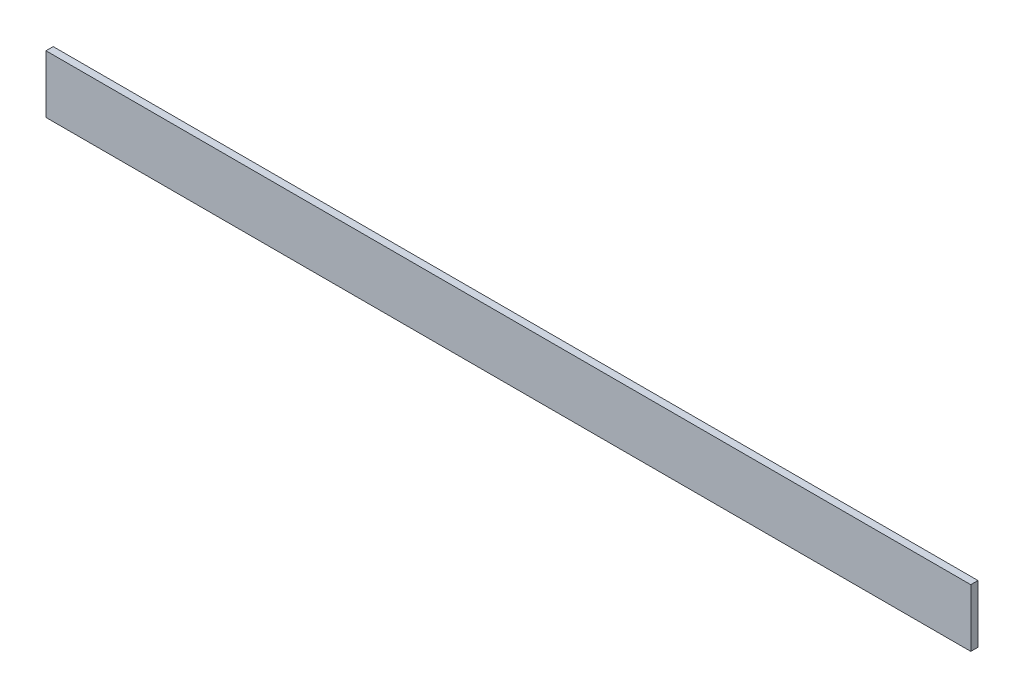
ISO-10303-21;
HEADER;
FILE_DESCRIPTION(('STEP AP214'),'2;1');
FILE_NAME('part.step','',(''),(''),'','','');
FILE_SCHEMA(('AUTOMOTIVE_DESIGN { 1 0 10303 214 1 1 1 1 }'));
ENDSEC;
DATA;
#1=APPLICATION_CONTEXT('core data for automotive mechanical design processes');
#2=APPLICATION_PROTOCOL_DEFINITION('international standard','automotive_design',2000,#1);
#3=PRODUCT_CONTEXT('',#1,'mechanical');
#4=PRODUCT('Part','Part','',(#3));
#5=PRODUCT_RELATED_PRODUCT_CATEGORY('part','',(#4));
#6=PRODUCT_DEFINITION_FORMATION('','',#4);
#7=PRODUCT_DEFINITION_CONTEXT('part definition',#1,'design');
#8=PRODUCT_DEFINITION('design','',#6,#7);
#9=PRODUCT_DEFINITION_SHAPE('','',#8);
#10=(LENGTH_UNIT() NAMED_UNIT(*) SI_UNIT(.MILLI.,.METRE.));
#11=(NAMED_UNIT(*) PLANE_ANGLE_UNIT() SI_UNIT($,.RADIAN.));
#12=(NAMED_UNIT(*) SI_UNIT($,.STERADIAN.) SOLID_ANGLE_UNIT());
#13=UNCERTAINTY_MEASURE_WITH_UNIT(LENGTH_MEASURE(1.E-05),#10,'distance_accuracy_value','');
#14=(GEOMETRIC_REPRESENTATION_CONTEXT(3) GLOBAL_UNCERTAINTY_ASSIGNED_CONTEXT((#13)) GLOBAL_UNIT_ASSIGNED_CONTEXT((#10,
#11,#12)) REPRESENTATION_CONTEXT('',''));
#15=CARTESIAN_POINT('',(0.,0.,0.));
#16=DIRECTION('',(0.,0.,1.));
#17=DIRECTION('',(1.,0.,0.));
#18=AXIS2_PLACEMENT_3D('',#15,#16,#17);
#19=CARTESIAN_POINT('',(320.,-20.,5.));
#20=DIRECTION('',(-1.,0.,0.));
#21=DIRECTION('',(0.,0.,1.));
#22=AXIS2_PLACEMENT_3D('',#19,#20,#21);
#23=PLANE('',#22);
#24=DIRECTION('',(0.,1.,0.));
#25=VECTOR('',#24,1.);
#26=CARTESIAN_POINT('',(320.,-20.,0.));
#27=LINE('',#26,#25);
#28=CARTESIAN_POINT('',(320.,-20.,0.));
#29=VERTEX_POINT('',#28);
#30=CARTESIAN_POINT('',(320.,20.,0.));
#31=VERTEX_POINT('',#30);
#32=EDGE_CURVE('E96',#29,#31,#27,.T.);
#33=ORIENTED_EDGE('',*,*,#32,.T.);
#34=DIRECTION('',(0.,0.,-1.));
#35=VECTOR('',#34,1.);
#36=CARTESIAN_POINT('',(320.,20.,5.));
#37=LINE('',#36,#35);
#38=CARTESIAN_POINT('',(320.,20.,5.));
#39=VERTEX_POINT('',#38);
#40=EDGE_CURVE('E11',#39,#31,#37,.T.);
#41=ORIENTED_EDGE('',*,*,#40,.F.);
#42=DIRECTION('',(0.,1.,0.));
#43=VECTOR('',#42,1.);
#44=CARTESIAN_POINT('',(320.,-20.,5.));
#45=LINE('',#44,#43);
#46=CARTESIAN_POINT('',(320.,-20.,5.));
#47=VERTEX_POINT('',#46);
#48=EDGE_CURVE('E84',#47,#39,#45,.T.);
#49=ORIENTED_EDGE('',*,*,#48,.F.);
#50=DIRECTION('',(0.,0.,-1.));
#51=VECTOR('',#50,1.);
#52=CARTESIAN_POINT('',(320.,-20.,5.));
#53=LINE('',#52,#51);
#54=EDGE_CURVE('E92',#47,#29,#53,.T.);
#55=ORIENTED_EDGE('',*,*,#54,.T.);
#56=EDGE_LOOP('',(#33,#41,#49,#55));
#57=FACE_BOUND('',#56,.T.);
#58=ADVANCED_FACE('F33',(#57),#23,.F.);
#59=CARTESIAN_POINT('',(-320.,20.,5.));
#60=DIRECTION('',(0.,-1.,0.));
#61=DIRECTION('',(0.,0.,-1.));
#62=AXIS2_PLACEMENT_3D('',#59,#60,#61);
#63=PLANE('',#62);
#64=DIRECTION('',(-1.,0.,0.));
#65=VECTOR('',#64,1.);
#66=CARTESIAN_POINT('',(-320.,20.,0.));
#67=LINE('',#66,#65);
#68=CARTESIAN_POINT('',(-320.,20.,0.));
#69=VERTEX_POINT('',#68);
#70=EDGE_CURVE('E88',#31,#69,#67,.T.);
#71=ORIENTED_EDGE('',*,*,#70,.T.);
#72=DIRECTION('',(0.,0.,-1.));
#73=VECTOR('',#72,1.);
#74=CARTESIAN_POINT('',(-320.,20.,5.));
#75=LINE('',#74,#73);
#76=CARTESIAN_POINT('',(-320.,20.,5.));
#77=VERTEX_POINT('',#76);
#78=EDGE_CURVE('E41',#77,#69,#75,.T.);
#79=ORIENTED_EDGE('',*,*,#78,.F.);
#80=DIRECTION('',(-1.,0.,0.));
#81=VECTOR('',#80,1.);
#82=CARTESIAN_POINT('',(-320.,20.,5.));
#83=LINE('',#82,#81);
#84=EDGE_CURVE('E79',#39,#77,#83,.T.);
#85=ORIENTED_EDGE('',*,*,#84,.F.);
#86=ORIENTED_EDGE('',*,*,#40,.T.);
#87=EDGE_LOOP('',(#71,#79,#85,#86));
#88=FACE_BOUND('',#87,.T.);
#89=ADVANCED_FACE('F87',(#88),#63,.F.);
#90=CARTESIAN_POINT('',(-320.,-20.,5.));
#91=DIRECTION('',(1.,0.,0.));
#92=DIRECTION('',(0.,0.,-1.));
#93=AXIS2_PLACEMENT_3D('',#90,#91,#92);
#94=PLANE('',#93);
#95=DIRECTION('',(0.,-1.,0.));
#96=VECTOR('',#95,1.);
#97=CARTESIAN_POINT('',(-320.,-20.,0.));
#98=LINE('',#97,#96);
#99=CARTESIAN_POINT('',(-320.,-20.,0.));
#100=VERTEX_POINT('',#99);
#101=EDGE_CURVE('E66',#69,#100,#98,.T.);
#102=ORIENTED_EDGE('',*,*,#101,.T.);
#103=DIRECTION('',(0.,0.,-1.));
#104=VECTOR('',#103,1.);
#105=CARTESIAN_POINT('',(-320.,-20.,5.));
#106=LINE('',#105,#104);
#107=CARTESIAN_POINT('',(-320.,-20.,5.));
#108=VERTEX_POINT('',#107);
#109=EDGE_CURVE('E89',#108,#100,#106,.T.);
#110=ORIENTED_EDGE('',*,*,#109,.F.);
#111=DIRECTION('',(0.,-1.,0.));
#112=VECTOR('',#111,1.);
#113=CARTESIAN_POINT('',(-320.,-20.,5.));
#114=LINE('',#113,#112);
#115=EDGE_CURVE('E82',#77,#108,#114,.T.);
#116=ORIENTED_EDGE('',*,*,#115,.F.);
#117=ORIENTED_EDGE('',*,*,#78,.T.);
#118=EDGE_LOOP('',(#102,#110,#116,#117));
#119=FACE_BOUND('',#118,.T.);
#120=ADVANCED_FACE('F90',(#119),#94,.F.);
#121=CARTESIAN_POINT('',(-320.,-20.,5.));
#122=DIRECTION('',(0.,1.,0.));
#123=DIRECTION('',(0.,0.,1.));
#124=AXIS2_PLACEMENT_3D('',#121,#122,#123);
#125=PLANE('',#124);
#126=DIRECTION('',(1.,0.,0.));
#127=VECTOR('',#126,1.);
#128=CARTESIAN_POINT('',(-320.,-20.,0.));
#129=LINE('',#128,#127);
#130=EDGE_CURVE('E72',#100,#29,#129,.T.);
#131=ORIENTED_EDGE('',*,*,#130,.T.);
#132=ORIENTED_EDGE('',*,*,#54,.F.);
#133=DIRECTION('',(1.,0.,0.));
#134=VECTOR('',#133,1.);
#135=CARTESIAN_POINT('',(-320.,-20.,5.));
#136=LINE('',#135,#134);
#137=EDGE_CURVE('E49',#108,#47,#136,.T.);
#138=ORIENTED_EDGE('',*,*,#137,.F.);
#139=ORIENTED_EDGE('',*,*,#109,.T.);
#140=EDGE_LOOP('',(#131,#132,#138,#139));
#141=FACE_BOUND('',#140,.T.);
#142=ADVANCED_FACE('F103',(#141),#125,.F.);
#143=CARTESIAN_POINT('',(0.,0.,5.));
#144=DIRECTION('',(0.,0.,-1.));
#145=DIRECTION('',(-1.,0.,0.));
#146=AXIS2_PLACEMENT_3D('',#143,#144,#145);
#147=PLANE('',#146);
#148=ORIENTED_EDGE('',*,*,#48,.T.);
#149=ORIENTED_EDGE('',*,*,#84,.T.);
#150=ORIENTED_EDGE('',*,*,#115,.T.);
#151=ORIENTED_EDGE('',*,*,#137,.T.);
#152=EDGE_LOOP('',(#148,#149,#150,#151));
#153=FACE_BOUND('',#152,.T.);
#154=ADVANCED_FACE('F80',(#153),#147,.F.);
#155=CARTESIAN_POINT('',(0.,0.,0.));
#156=DIRECTION('',(0.,0.,-1.));
#157=DIRECTION('',(-1.,0.,0.));
#158=AXIS2_PLACEMENT_3D('',#155,#156,#157);
#159=PLANE('',#158);
#160=ORIENTED_EDGE('',*,*,#32,.F.);
#161=ORIENTED_EDGE('',*,*,#130,.F.);
#162=ORIENTED_EDGE('',*,*,#101,.F.);
#163=ORIENTED_EDGE('',*,*,#70,.F.);
#164=EDGE_LOOP('',(#160,#161,#162,#163));
#165=FACE_BOUND('',#164,.T.);
#166=ADVANCED_FACE('F106',(#165),#159,.T.);
#167=CLOSED_SHELL('',(#58,#89,#120,#142,#154,#166));
#168=MANIFOLD_SOLID_BREP('B2',#167);
#169=ADVANCED_BREP_SHAPE_REPRESENTATION('',(#18,#168),#14);
#170=SHAPE_DEFINITION_REPRESENTATION(#9,#169);
ENDSEC;
END-ISO-10303-21;
